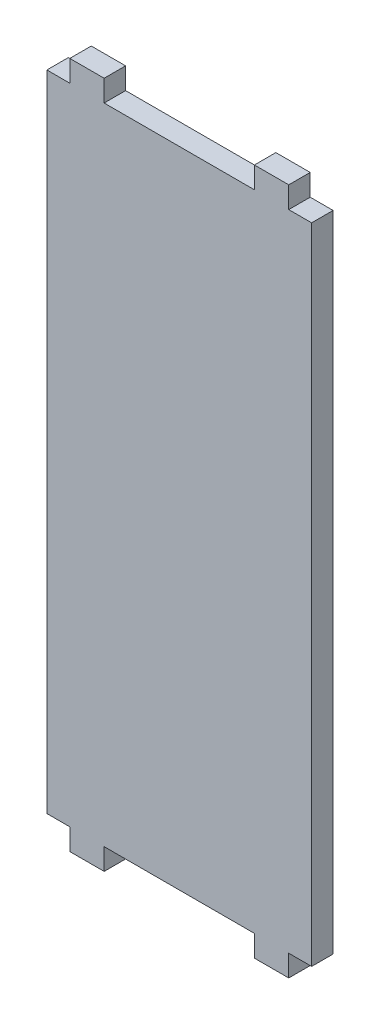
ISO-10303-21;
HEADER;
FILE_DESCRIPTION(('STEP AP214'),'2;1');
FILE_NAME('part.step','',(''),(''),'','','');
FILE_SCHEMA(('AUTOMOTIVE_DESIGN { 1 0 10303 214 1 1 1 1 }'));
ENDSEC;
DATA;
#1=APPLICATION_CONTEXT('core data for automotive mechanical design processes');
#2=APPLICATION_PROTOCOL_DEFINITION('international standard','automotive_design',2000,#1);
#3=PRODUCT_CONTEXT('',#1,'mechanical');
#4=PRODUCT('Part','Part','',(#3));
#5=PRODUCT_RELATED_PRODUCT_CATEGORY('part','',(#4));
#6=PRODUCT_DEFINITION_FORMATION('','',#4);
#7=PRODUCT_DEFINITION_CONTEXT('part definition',#1,'design');
#8=PRODUCT_DEFINITION('design','',#6,#7);
#9=PRODUCT_DEFINITION_SHAPE('','',#8);
#10=(LENGTH_UNIT() NAMED_UNIT(*) SI_UNIT(.MILLI.,.METRE.));
#11=(NAMED_UNIT(*) PLANE_ANGLE_UNIT() SI_UNIT($,.RADIAN.));
#12=(NAMED_UNIT(*) SI_UNIT($,.STERADIAN.) SOLID_ANGLE_UNIT());
#13=UNCERTAINTY_MEASURE_WITH_UNIT(LENGTH_MEASURE(1.E-05),#10,'distance_accuracy_value','');
#14=(GEOMETRIC_REPRESENTATION_CONTEXT(3) GLOBAL_UNCERTAINTY_ASSIGNED_CONTEXT((#13)) GLOBAL_UNIT_ASSIGNED_CONTEXT((#10,
#11,#12)) REPRESENTATION_CONTEXT('',''));
#15=CARTESIAN_POINT('',(0.,0.,0.));
#16=DIRECTION('',(0.,0.,1.));
#17=DIRECTION('',(1.,0.,0.));
#18=AXIS2_PLACEMENT_3D('',#15,#16,#17);
#19=CARTESIAN_POINT('',(0.,142.875,4.7625));
#20=DIRECTION('',(0.,-1.,0.));
#21=DIRECTION('',(1.,0.,0.));
#22=AXIS2_PLACEMENT_3D('',#19,#20,#21);
#23=PLANE('',#22);
#24=DIRECTION('',(-1.,0.,0.));
#25=VECTOR('',#24,1.);
#26=CARTESIAN_POINT('',(0.,142.875,0.));
#27=LINE('',#26,#25);
#28=CARTESIAN_POINT('',(0.,142.875,0.));
#29=VERTEX_POINT('',#28);
#30=CARTESIAN_POINT('',(-5.07999999999998,142.875,0.));
#31=VERTEX_POINT('',#30);
#32=EDGE_CURVE('E246',#29,#31,#27,.T.);
#33=ORIENTED_EDGE('',*,*,#32,.T.);
#34=DIRECTION('',(0.,0.,-1.));
#35=VECTOR('',#34,1.);
#36=CARTESIAN_POINT('',(-5.07999999999998,142.875,4.76249999999998));
#37=LINE('',#36,#35);
#38=CARTESIAN_POINT('',(-5.07999999999998,142.875,4.76249999999998));
#39=VERTEX_POINT('',#38);
#40=EDGE_CURVE('E166',#39,#31,#37,.T.);
#41=ORIENTED_EDGE('',*,*,#40,.F.);
#42=DIRECTION('',(-1.,0.,0.));
#43=VECTOR('',#42,1.);
#44=CARTESIAN_POINT('',(0.,142.875,4.7625));
#45=LINE('',#44,#43);
#46=CARTESIAN_POINT('',(0.,142.875,4.7625));
#47=VERTEX_POINT('',#46);
#48=EDGE_CURVE('E288',#47,#39,#45,.T.);
#49=ORIENTED_EDGE('',*,*,#48,.F.);
#50=DIRECTION('',(0.,0.,-1.));
#51=VECTOR('',#50,1.);
#52=CARTESIAN_POINT('',(0.,142.875,4.7625));
#53=LINE('',#52,#51);
#54=EDGE_CURVE('E163',#47,#29,#53,.T.);
#55=ORIENTED_EDGE('',*,*,#54,.T.);
#56=EDGE_LOOP('',(#33,#41,#49,#55));
#57=FACE_BOUND('',#56,.T.);
#58=ADVANCED_FACE('F93',(#57),#23,.F.);
#59=CARTESIAN_POINT('',(-5.07999999999998,0.,4.7625));
#60=DIRECTION('',(1.,0.,0.));
#61=DIRECTION('',(0.,1.,0.));
#62=AXIS2_PLACEMENT_3D('',#59,#60,#61);
#63=PLANE('',#62);
#64=DIRECTION('',(0.,-1.,0.));
#65=VECTOR('',#64,1.);
#66=CARTESIAN_POINT('',(-5.07999999999998,0.,0.));
#67=LINE('',#66,#65);
#68=CARTESIAN_POINT('',(-5.07999999999995,147.6375,0.));
#69=VERTEX_POINT('',#68);
#70=EDGE_CURVE('E243',#69,#31,#67,.T.);
#71=ORIENTED_EDGE('',*,*,#70,.F.);
#72=DIRECTION('',(0.,0.,-1.));
#73=VECTOR('',#72,1.);
#74=CARTESIAN_POINT('',(-5.07999999999995,147.6375,4.76249999999997));
#75=LINE('',#74,#73);
#76=CARTESIAN_POINT('',(-5.07999999999995,147.6375,4.76249999999997));
#77=VERTEX_POINT('',#76);
#78=EDGE_CURVE('E169',#77,#69,#75,.T.);
#79=ORIENTED_EDGE('',*,*,#78,.F.);
#80=DIRECTION('',(0.,-1.,0.));
#81=VECTOR('',#80,1.);
#82=CARTESIAN_POINT('',(-5.07999999999998,0.,4.7625));
#83=LINE('',#82,#81);
#84=EDGE_CURVE('E285',#77,#39,#83,.T.);
#85=ORIENTED_EDGE('',*,*,#84,.T.);
#86=ORIENTED_EDGE('',*,*,#40,.T.);
#87=EDGE_LOOP('',(#71,#79,#85,#86));
#88=FACE_BOUND('',#87,.T.);
#89=ADVANCED_FACE('F401',(#88),#63,.T.);
#90=CARTESIAN_POINT('',(0.,147.6375,4.76249999999997));
#91=DIRECTION('',(0.,-1.,0.));
#92=DIRECTION('',(1.,0.,0.));
#93=AXIS2_PLACEMENT_3D('',#90,#91,#92);
#94=PLANE('',#93);
#95=DIRECTION('',(-1.,0.,0.));
#96=VECTOR('',#95,1.);
#97=CARTESIAN_POINT('',(0.,147.6375,0.));
#98=LINE('',#97,#96);
#99=CARTESIAN_POINT('',(-12.7,147.6375,0.));
#100=VERTEX_POINT('',#99);
#101=EDGE_CURVE('E240',#69,#100,#98,.T.);
#102=ORIENTED_EDGE('',*,*,#101,.T.);
#103=DIRECTION('',(0.,0.,-1.));
#104=VECTOR('',#103,1.);
#105=CARTESIAN_POINT('',(-12.7,147.6375,4.76249999999997));
#106=LINE('',#105,#104);
#107=CARTESIAN_POINT('',(-12.7,147.6375,4.76249999999997));
#108=VERTEX_POINT('',#107);
#109=EDGE_CURVE('E172',#108,#100,#106,.T.);
#110=ORIENTED_EDGE('',*,*,#109,.F.);
#111=DIRECTION('',(-1.,0.,0.));
#112=VECTOR('',#111,1.);
#113=CARTESIAN_POINT('',(0.,147.6375,4.76249999999997));
#114=LINE('',#113,#112);
#115=EDGE_CURVE('E282',#77,#108,#114,.T.);
#116=ORIENTED_EDGE('',*,*,#115,.F.);
#117=ORIENTED_EDGE('',*,*,#78,.T.);
#118=EDGE_LOOP('',(#102,#110,#116,#117));
#119=FACE_BOUND('',#118,.T.);
#120=ADVANCED_FACE('F460',(#119),#94,.F.);
#121=CARTESIAN_POINT('',(-12.7,0.,4.7625));
#122=DIRECTION('',(1.,0.,0.));
#123=DIRECTION('',(0.,1.,0.));
#124=AXIS2_PLACEMENT_3D('',#121,#122,#123);
#125=PLANE('',#124);
#126=DIRECTION('',(0.,-1.,0.));
#127=VECTOR('',#126,1.);
#128=CARTESIAN_POINT('',(-12.7,0.,0.));
#129=LINE('',#128,#127);
#130=CARTESIAN_POINT('',(-12.7,142.875,0.));
#131=VERTEX_POINT('',#130);
#132=EDGE_CURVE('E237',#100,#131,#129,.T.);
#133=ORIENTED_EDGE('',*,*,#132,.T.);
#134=DIRECTION('',(0.,0.,-1.));
#135=VECTOR('',#134,1.);
#136=CARTESIAN_POINT('',(-12.7,142.875,4.7625));
#137=LINE('',#136,#135);
#138=CARTESIAN_POINT('',(-12.7,142.875,4.7625));
#139=VERTEX_POINT('',#138);
#140=EDGE_CURVE('E175',#139,#131,#137,.T.);
#141=ORIENTED_EDGE('',*,*,#140,.F.);
#142=DIRECTION('',(0.,-1.,0.));
#143=VECTOR('',#142,1.);
#144=CARTESIAN_POINT('',(-12.7,0.,4.7625));
#145=LINE('',#144,#143);
#146=EDGE_CURVE('E279',#108,#139,#145,.T.);
#147=ORIENTED_EDGE('',*,*,#146,.F.);
#148=ORIENTED_EDGE('',*,*,#109,.T.);
#149=EDGE_LOOP('',(#133,#141,#147,#148));
#150=FACE_BOUND('',#149,.T.);
#151=ADVANCED_FACE('F392',(#150),#125,.F.);
#152=CARTESIAN_POINT('',(-46.0375,142.875,0.));
#153=VERTEX_POINT('',#152);
#154=EDGE_CURVE('E236',#131,#153,#27,.T.);
#155=ORIENTED_EDGE('',*,*,#154,.T.);
#156=DIRECTION('',(0.,0.,-1.));
#157=VECTOR('',#156,1.);
#158=CARTESIAN_POINT('',(-46.0375,142.875,4.7625));
#159=LINE('',#158,#157);
#160=CARTESIAN_POINT('',(-46.0375,142.875,4.7625));
#161=VERTEX_POINT('',#160);
#162=EDGE_CURVE('E178',#161,#153,#159,.T.);
#163=ORIENTED_EDGE('',*,*,#162,.F.);
#164=EDGE_CURVE('E278',#139,#161,#45,.T.);
#165=ORIENTED_EDGE('',*,*,#164,.F.);
#166=ORIENTED_EDGE('',*,*,#140,.T.);
#167=EDGE_LOOP('',(#155,#163,#165,#166));
#168=FACE_BOUND('',#167,.T.);
#169=ADVANCED_FACE('F331',(#168),#23,.F.);
#170=CARTESIAN_POINT('',(-46.0375,0.,4.7625));
#171=DIRECTION('',(-1.,0.,0.));
#172=DIRECTION('',(0.,-1.,0.));
#173=AXIS2_PLACEMENT_3D('',#170,#171,#172);
#174=PLANE('',#173);
#175=DIRECTION('',(0.,1.,0.));
#176=VECTOR('',#175,1.);
#177=CARTESIAN_POINT('',(-46.0375,0.,0.));
#178=LINE('',#177,#176);
#179=CARTESIAN_POINT('',(-46.0375,147.6375,0.));
#180=VERTEX_POINT('',#179);
#181=EDGE_CURVE('E233',#153,#180,#178,.T.);
#182=ORIENTED_EDGE('',*,*,#181,.T.);
#183=DIRECTION('',(0.,0.,-1.));
#184=VECTOR('',#183,1.);
#185=CARTESIAN_POINT('',(-46.0375,147.6375,4.76249999999994));
#186=LINE('',#185,#184);
#187=CARTESIAN_POINT('',(-46.0375,147.6375,4.76249999999994));
#188=VERTEX_POINT('',#187);
#189=EDGE_CURVE('E181',#188,#180,#186,.T.);
#190=ORIENTED_EDGE('',*,*,#189,.F.);
#191=DIRECTION('',(0.,1.,0.));
#192=VECTOR('',#191,1.);
#193=CARTESIAN_POINT('',(-46.0375,0.,4.7625));
#194=LINE('',#193,#192);
#195=EDGE_CURVE('E275',#161,#188,#194,.T.);
#196=ORIENTED_EDGE('',*,*,#195,.F.);
#197=ORIENTED_EDGE('',*,*,#162,.T.);
#198=EDGE_LOOP('',(#182,#190,#196,#197));
#199=FACE_BOUND('',#198,.T.);
#200=ADVANCED_FACE('F342',(#199),#174,.F.);
#201=CARTESIAN_POINT('',(0.,147.6375,4.76249999999994));
#202=DIRECTION('',(0.,-1.,0.));
#203=DIRECTION('',(1.,0.,0.));
#204=AXIS2_PLACEMENT_3D('',#201,#202,#203);
#205=PLANE('',#204);
#206=DIRECTION('',(-1.,0.,0.));
#207=VECTOR('',#206,1.);
#208=CARTESIAN_POINT('',(0.,147.6375,0.));
#209=LINE('',#208,#207);
#210=CARTESIAN_POINT('',(-53.6575,147.6375,0.));
#211=VERTEX_POINT('',#210);
#212=EDGE_CURVE('E230',#180,#211,#209,.T.);
#213=ORIENTED_EDGE('',*,*,#212,.T.);
#214=DIRECTION('',(0.,0.,-1.));
#215=VECTOR('',#214,1.);
#216=CARTESIAN_POINT('',(-53.6575,147.6375,4.76249999999994));
#217=LINE('',#216,#215);
#218=CARTESIAN_POINT('',(-53.6575,147.6375,4.76249999999994));
#219=VERTEX_POINT('',#218);
#220=EDGE_CURVE('E184',#219,#211,#217,.T.);
#221=ORIENTED_EDGE('',*,*,#220,.F.);
#222=DIRECTION('',(-1.,0.,0.));
#223=VECTOR('',#222,1.);
#224=CARTESIAN_POINT('',(0.,147.6375,4.76249999999994));
#225=LINE('',#224,#223);
#226=EDGE_CURVE('E272',#188,#219,#225,.T.);
#227=ORIENTED_EDGE('',*,*,#226,.F.);
#228=ORIENTED_EDGE('',*,*,#189,.T.);
#229=EDGE_LOOP('',(#213,#221,#227,#228));
#230=FACE_BOUND('',#229,.T.);
#231=ADVANCED_FACE('F349',(#230),#205,.F.);
#232=CARTESIAN_POINT('',(-53.6575,0.,4.7625));
#233=DIRECTION('',(-1.,0.,0.));
#234=DIRECTION('',(0.,-1.,0.));
#235=AXIS2_PLACEMENT_3D('',#232,#233,#234);
#236=PLANE('',#235);
#237=DIRECTION('',(0.,1.,0.));
#238=VECTOR('',#237,1.);
#239=CARTESIAN_POINT('',(-53.6575,0.,0.));
#240=LINE('',#239,#238);
#241=CARTESIAN_POINT('',(-53.6575,142.875,0.));
#242=VERTEX_POINT('',#241);
#243=EDGE_CURVE('E227',#242,#211,#240,.T.);
#244=ORIENTED_EDGE('',*,*,#243,.F.);
#245=DIRECTION('',(0.,0.,-1.));
#246=VECTOR('',#245,1.);
#247=CARTESIAN_POINT('',(-53.6575,142.875,4.76249999999997));
#248=LINE('',#247,#246);
#249=CARTESIAN_POINT('',(-53.6575,142.875,4.76249999999997));
#250=VERTEX_POINT('',#249);
#251=EDGE_CURVE('E187',#250,#242,#248,.T.);
#252=ORIENTED_EDGE('',*,*,#251,.F.);
#253=DIRECTION('',(0.,1.,0.));
#254=VECTOR('',#253,1.);
#255=CARTESIAN_POINT('',(-53.6575,0.,4.7625));
#256=LINE('',#255,#254);
#257=EDGE_CURVE('E269',#250,#219,#256,.T.);
#258=ORIENTED_EDGE('',*,*,#257,.T.);
#259=ORIENTED_EDGE('',*,*,#220,.T.);
#260=EDGE_LOOP('',(#244,#252,#258,#259));
#261=FACE_BOUND('',#260,.T.);
#262=ADVANCED_FACE('F466',(#261),#236,.T.);
#263=CARTESIAN_POINT('',(-58.7375,142.875,0.));
#264=VERTEX_POINT('',#263);
#265=EDGE_CURVE('E226',#242,#264,#27,.T.);
#266=ORIENTED_EDGE('',*,*,#265,.T.);
#267=DIRECTION('',(0.,0.,-1.));
#268=VECTOR('',#267,1.);
#269=CARTESIAN_POINT('',(-58.7375,142.875,4.7625));
#270=LINE('',#269,#268);
#271=CARTESIAN_POINT('',(-58.7375,142.875,4.7625));
#272=VERTEX_POINT('',#271);
#273=EDGE_CURVE('E190',#272,#264,#270,.T.);
#274=ORIENTED_EDGE('',*,*,#273,.F.);
#275=EDGE_CURVE('E268',#250,#272,#45,.T.);
#276=ORIENTED_EDGE('',*,*,#275,.F.);
#277=ORIENTED_EDGE('',*,*,#251,.T.);
#278=EDGE_LOOP('',(#266,#274,#276,#277));
#279=FACE_BOUND('',#278,.T.);
#280=ADVANCED_FACE('F323',(#279),#23,.F.);
#281=CARTESIAN_POINT('',(-58.7375,0.,4.7625));
#282=DIRECTION('',(-1.,0.,0.));
#283=DIRECTION('',(0.,-1.,0.));
#284=AXIS2_PLACEMENT_3D('',#281,#282,#283);
#285=PLANE('',#284);
#286=DIRECTION('',(0.,1.,0.));
#287=VECTOR('',#286,1.);
#288=CARTESIAN_POINT('',(-58.7375,0.,0.));
#289=LINE('',#288,#287);
#290=CARTESIAN_POINT('',(-58.7375,0.,0.));
#291=VERTEX_POINT('',#290);
#292=EDGE_CURVE('E223',#291,#264,#289,.T.);
#293=ORIENTED_EDGE('',*,*,#292,.F.);
#294=DIRECTION('',(0.,0.,-1.));
#295=VECTOR('',#294,1.);
#296=CARTESIAN_POINT('',(-58.7375,0.,4.7625));
#297=LINE('',#296,#295);
#298=CARTESIAN_POINT('',(-58.7375,0.,4.7625));
#299=VERTEX_POINT('',#298);
#300=EDGE_CURVE('E193',#299,#291,#297,.T.);
#301=ORIENTED_EDGE('',*,*,#300,.F.);
#302=DIRECTION('',(0.,1.,0.));
#303=VECTOR('',#302,1.);
#304=CARTESIAN_POINT('',(-58.7375,0.,4.7625));
#305=LINE('',#304,#303);
#306=EDGE_CURVE('E265',#299,#272,#305,.T.);
#307=ORIENTED_EDGE('',*,*,#306,.T.);
#308=ORIENTED_EDGE('',*,*,#273,.T.);
#309=EDGE_LOOP('',(#293,#301,#307,#308));
#310=FACE_BOUND('',#309,.T.);
#311=ADVANCED_FACE('F315',(#310),#285,.T.);
#312=CARTESIAN_POINT('',(0.,0.,4.7625));
#313=DIRECTION('',(0.,-1.,0.));
#314=DIRECTION('',(1.,0.,0.));
#315=AXIS2_PLACEMENT_3D('',#312,#313,#314);
#316=PLANE('',#315);
#317=DIRECTION('',(0.,0.,-1.));
#318=VECTOR('',#317,1.);
#319=CARTESIAN_POINT('',(-53.6575,0.,4.7625));
#320=LINE('',#319,#318);
#321=CARTESIAN_POINT('',(-53.6575,0.,4.7625));
#322=VERTEX_POINT('',#321);
#323=CARTESIAN_POINT('',(-53.6575,0.,0.));
#324=VERTEX_POINT('',#323);
#325=EDGE_CURVE('E103',#322,#324,#320,.T.);
#326=ORIENTED_EDGE('',*,*,#325,.F.);
#327=DIRECTION('',(-1.,0.,0.));
#328=VECTOR('',#327,1.);
#329=CARTESIAN_POINT('',(0.,0.,4.7625));
#330=LINE('',#329,#328);
#331=EDGE_CURVE('E264',#322,#299,#330,.T.);
#332=ORIENTED_EDGE('',*,*,#331,.T.);
#333=ORIENTED_EDGE('',*,*,#300,.T.);
#334=DIRECTION('',(-1.,0.,0.));
#335=VECTOR('',#334,1.);
#336=CARTESIAN_POINT('',(0.,0.,0.));
#337=LINE('',#336,#335);
#338=EDGE_CURVE('E222',#324,#291,#337,.T.);
#339=ORIENTED_EDGE('',*,*,#338,.F.);
#340=EDGE_LOOP('',(#326,#332,#333,#339));
#341=FACE_BOUND('',#340,.T.);
#342=ADVANCED_FACE('F310',(#341),#316,.T.);
#343=CARTESIAN_POINT('',(-12.7,0.,4.7625));
#344=VERTEX_POINT('',#343);
#345=CARTESIAN_POINT('',(-46.0375,0.,4.7625));
#346=VERTEX_POINT('',#345);
#347=EDGE_CURVE('E261',#344,#346,#330,.T.);
#348=ORIENTED_EDGE('',*,*,#347,.T.);
#349=DIRECTION('',(0.,0.,-1.));
#350=VECTOR('',#349,1.);
#351=CARTESIAN_POINT('',(-46.0375,0.,4.7625));
#352=LINE('',#351,#350);
#353=CARTESIAN_POINT('',(-46.0375,0.,0.));
#354=VERTEX_POINT('',#353);
#355=EDGE_CURVE('E12',#346,#354,#352,.T.);
#356=ORIENTED_EDGE('',*,*,#355,.T.);
#357=CARTESIAN_POINT('',(-12.7,0.,0.));
#358=VERTEX_POINT('',#357);
#359=EDGE_CURVE('E151',#358,#354,#337,.T.);
#360=ORIENTED_EDGE('',*,*,#359,.F.);
#361=DIRECTION('',(0.,0.,-1.));
#362=VECTOR('',#361,1.);
#363=CARTESIAN_POINT('',(-12.7,0.,4.7625));
#364=LINE('',#363,#362);
#365=EDGE_CURVE('E196',#344,#358,#364,.T.);
#366=ORIENTED_EDGE('',*,*,#365,.F.);
#367=EDGE_LOOP('',(#348,#356,#360,#366));
#368=FACE_BOUND('',#367,.T.);
#369=ADVANCED_FACE('F444',(#368),#316,.T.);
#370=CARTESIAN_POINT('',(-12.7,0.,4.7625));
#371=DIRECTION('',(-1.,0.,0.));
#372=DIRECTION('',(0.,-1.,0.));
#373=AXIS2_PLACEMENT_3D('',#370,#371,#372);
#374=PLANE('',#373);
#375=DIRECTION('',(0.,1.,0.));
#376=VECTOR('',#375,1.);
#377=CARTESIAN_POINT('',(-12.7,0.,0.));
#378=LINE('',#377,#376);
#379=CARTESIAN_POINT('',(-12.7,-4.7625,0.));
#380=VERTEX_POINT('',#379);
#381=EDGE_CURVE('E219',#380,#358,#378,.T.);
#382=ORIENTED_EDGE('',*,*,#381,.F.);
#383=DIRECTION('',(0.,0.,-1.));
#384=VECTOR('',#383,1.);
#385=CARTESIAN_POINT('',(-12.7,-4.7625,4.7625));
#386=LINE('',#385,#384);
#387=CARTESIAN_POINT('',(-12.7,-4.7625,4.7625));
#388=VERTEX_POINT('',#387);
#389=EDGE_CURVE('E199',#388,#380,#386,.T.);
#390=ORIENTED_EDGE('',*,*,#389,.F.);
#391=DIRECTION('',(0.,1.,0.));
#392=VECTOR('',#391,1.);
#393=CARTESIAN_POINT('',(-12.7,0.,4.7625));
#394=LINE('',#393,#392);
#395=EDGE_CURVE('E258',#388,#344,#394,.T.);
#396=ORIENTED_EDGE('',*,*,#395,.T.);
#397=ORIENTED_EDGE('',*,*,#365,.T.);
#398=EDGE_LOOP('',(#382,#390,#396,#397));
#399=FACE_BOUND('',#398,.T.);
#400=ADVANCED_FACE('F442',(#399),#374,.T.);
#401=CARTESIAN_POINT('',(0.,-4.7625,4.7625));
#402=DIRECTION('',(0.,-1.,0.));
#403=DIRECTION('',(1.,0.,0.));
#404=AXIS2_PLACEMENT_3D('',#401,#402,#403);
#405=PLANE('',#404);
#406=DIRECTION('',(-1.,0.,0.));
#407=VECTOR('',#406,1.);
#408=CARTESIAN_POINT('',(0.,-4.7625,0.));
#409=LINE('',#408,#407);
#410=CARTESIAN_POINT('',(-5.07999999999993,-4.76250000000009,0.));
#411=VERTEX_POINT('',#410);
#412=EDGE_CURVE('E216',#411,#380,#409,.T.);
#413=ORIENTED_EDGE('',*,*,#412,.F.);
#414=DIRECTION('',(0.,0.,-1.));
#415=VECTOR('',#414,1.);
#416=CARTESIAN_POINT('',(-5.07999999999993,-4.76250000000009,4.76249999999991));
#417=LINE('',#416,#415);
#418=CARTESIAN_POINT('',(-5.07999999999993,-4.76250000000009,4.76249999999991));
#419=VERTEX_POINT('',#418);
#420=EDGE_CURVE('E202',#419,#411,#417,.T.);
#421=ORIENTED_EDGE('',*,*,#420,.F.);
#422=DIRECTION('',(-1.,0.,0.));
#423=VECTOR('',#422,1.);
#424=CARTESIAN_POINT('',(0.,-4.7625,4.7625));
#425=LINE('',#424,#423);
#426=EDGE_CURVE('E255',#419,#388,#425,.T.);
#427=ORIENTED_EDGE('',*,*,#426,.T.);
#428=ORIENTED_EDGE('',*,*,#389,.T.);
#429=EDGE_LOOP('',(#413,#421,#427,#428));
#430=FACE_BOUND('',#429,.T.);
#431=ADVANCED_FACE('F435',(#430),#405,.T.);
#432=CARTESIAN_POINT('',(-5.08000000000002,0.,4.7625));
#433=DIRECTION('',(-1.,0.,0.));
#434=DIRECTION('',(0.,-1.,0.));
#435=AXIS2_PLACEMENT_3D('',#432,#433,#434);
#436=PLANE('',#435);
#437=DIRECTION('',(0.,1.,0.));
#438=VECTOR('',#437,1.);
#439=CARTESIAN_POINT('',(-5.08000000000002,0.,0.));
#440=LINE('',#439,#438);
#441=CARTESIAN_POINT('',(-5.08000000000002,0.,0.));
#442=VERTEX_POINT('',#441);
#443=EDGE_CURVE('E212',#411,#442,#440,.T.);
#444=ORIENTED_EDGE('',*,*,#443,.T.);
#445=DIRECTION('',(0.,0.,-1.));
#446=VECTOR('',#445,1.);
#447=CARTESIAN_POINT('',(-5.08000000000002,0.,4.7625));
#448=LINE('',#447,#446);
#449=CARTESIAN_POINT('',(-5.08000000000002,0.,4.7625));
#450=VERTEX_POINT('',#449);
#451=EDGE_CURVE('E205',#450,#442,#448,.T.);
#452=ORIENTED_EDGE('',*,*,#451,.F.);
#453=DIRECTION('',(0.,1.,0.));
#454=VECTOR('',#453,1.);
#455=CARTESIAN_POINT('',(-5.08000000000002,0.,4.7625));
#456=LINE('',#455,#454);
#457=EDGE_CURVE('E252',#419,#450,#456,.T.);
#458=ORIENTED_EDGE('',*,*,#457,.F.);
#459=ORIENTED_EDGE('',*,*,#420,.T.);
#460=EDGE_LOOP('',(#444,#452,#458,#459));
#461=FACE_BOUND('',#460,.T.);
#462=ADVANCED_FACE('F437',(#461),#436,.F.);
#463=CARTESIAN_POINT('',(0.,0.,0.));
#464=VERTEX_POINT('',#463);
#465=EDGE_CURVE('E215',#464,#442,#337,.T.);
#466=ORIENTED_EDGE('',*,*,#465,.F.);
#467=DIRECTION('',(0.,0.,-1.));
#468=VECTOR('',#467,1.);
#469=CARTESIAN_POINT('',(0.,0.,4.7625));
#470=LINE('',#469,#468);
#471=CARTESIAN_POINT('',(0.,0.,4.7625));
#472=VERTEX_POINT('',#471);
#473=EDGE_CURVE('E208',#472,#464,#470,.T.);
#474=ORIENTED_EDGE('',*,*,#473,.F.);
#475=EDGE_CURVE('E211',#472,#450,#330,.T.);
#476=ORIENTED_EDGE('',*,*,#475,.T.);
#477=ORIENTED_EDGE('',*,*,#451,.T.);
#478=EDGE_LOOP('',(#466,#474,#476,#477));
#479=FACE_BOUND('',#478,.T.);
#480=ADVANCED_FACE('F374',(#479),#316,.T.);
#481=CARTESIAN_POINT('',(0.,0.,4.7625));
#482=DIRECTION('',(-1.,0.,0.));
#483=DIRECTION('',(0.,-1.,0.));
#484=AXIS2_PLACEMENT_3D('',#481,#482,#483);
#485=PLANE('',#484);
#486=DIRECTION('',(0.,1.,0.));
#487=VECTOR('',#486,1.);
#488=CARTESIAN_POINT('',(0.,0.,0.));
#489=LINE('',#488,#487);
#490=EDGE_CURVE('E249',#464,#29,#489,.T.);
#491=ORIENTED_EDGE('',*,*,#490,.T.);
#492=ORIENTED_EDGE('',*,*,#54,.F.);
#493=DIRECTION('',(0.,1.,0.));
#494=VECTOR('',#493,1.);
#495=CARTESIAN_POINT('',(0.,0.,4.7625));
#496=LINE('',#495,#494);
#497=EDGE_CURVE('E291',#472,#47,#496,.T.);
#498=ORIENTED_EDGE('',*,*,#497,.F.);
#499=ORIENTED_EDGE('',*,*,#473,.T.);
#500=EDGE_LOOP('',(#491,#492,#498,#499));
#501=FACE_BOUND('',#500,.T.);
#502=ADVANCED_FACE('F410',(#501),#485,.F.);
#503=CARTESIAN_POINT('',(0.,0.,0.));
#504=DIRECTION('',(0.,0.,1.));
#505=DIRECTION('',(1.,0.,0.));
#506=AXIS2_PLACEMENT_3D('',#503,#504,#505);
#507=PLANE('',#506);
#508=ORIENTED_EDGE('',*,*,#490,.F.);
#509=ORIENTED_EDGE('',*,*,#465,.T.);
#510=ORIENTED_EDGE('',*,*,#443,.F.);
#511=ORIENTED_EDGE('',*,*,#412,.T.);
#512=ORIENTED_EDGE('',*,*,#381,.T.);
#513=ORIENTED_EDGE('',*,*,#359,.T.);
#514=DIRECTION('',(0.,1.,0.));
#515=VECTOR('',#514,1.);
#516=CARTESIAN_POINT('',(-46.0375,-4.76249999999999,0.));
#517=LINE('',#516,#515);
#518=CARTESIAN_POINT('',(-46.0375,-4.76249999999999,0.));
#519=VERTEX_POINT('',#518);
#520=EDGE_CURVE('E137',#519,#354,#517,.T.);
#521=ORIENTED_EDGE('',*,*,#520,.F.);
#522=DIRECTION('',(-1.,0.,0.));
#523=VECTOR('',#522,1.);
#524=CARTESIAN_POINT('',(-46.0375,-4.76249999999999,0.));
#525=LINE('',#524,#523);
#526=CARTESIAN_POINT('',(-53.6575,-4.76249999999999,0.));
#527=VERTEX_POINT('',#526);
#528=EDGE_CURVE('E148',#519,#527,#525,.T.);
#529=ORIENTED_EDGE('',*,*,#528,.T.);
#530=DIRECTION('',(0.,1.,0.));
#531=VECTOR('',#530,1.);
#532=CARTESIAN_POINT('',(-53.6575,-4.76249999999999,0.));
#533=LINE('',#532,#531);
#534=EDGE_CURVE('E152',#527,#324,#533,.T.);
#535=ORIENTED_EDGE('',*,*,#534,.T.);
#536=ORIENTED_EDGE('',*,*,#338,.T.);
#537=ORIENTED_EDGE('',*,*,#292,.T.);
#538=ORIENTED_EDGE('',*,*,#265,.F.);
#539=ORIENTED_EDGE('',*,*,#243,.T.);
#540=ORIENTED_EDGE('',*,*,#212,.F.);
#541=ORIENTED_EDGE('',*,*,#181,.F.);
#542=ORIENTED_EDGE('',*,*,#154,.F.);
#543=ORIENTED_EDGE('',*,*,#132,.F.);
#544=ORIENTED_EDGE('',*,*,#101,.F.);
#545=ORIENTED_EDGE('',*,*,#70,.T.);
#546=ORIENTED_EDGE('',*,*,#32,.F.);
#547=EDGE_LOOP('',(#508,#509,#510,#511,#512,#513,#521,#529,#535,#536,#537,#538,#539,#540,#541,
#542,#543,#544,#545,#546));
#548=FACE_BOUND('',#547,.T.);
#549=ADVANCED_FACE('F146',(#548),#507,.F.);
#550=CARTESIAN_POINT('',(0.,0.,4.7625));
#551=DIRECTION('',(0.,0.,1.));
#552=DIRECTION('',(1.,0.,0.));
#553=AXIS2_PLACEMENT_3D('',#550,#551,#552);
#554=PLANE('',#553);
#555=ORIENTED_EDGE('',*,*,#497,.T.);
#556=ORIENTED_EDGE('',*,*,#48,.T.);
#557=ORIENTED_EDGE('',*,*,#84,.F.);
#558=ORIENTED_EDGE('',*,*,#115,.T.);
#559=ORIENTED_EDGE('',*,*,#146,.T.);
#560=ORIENTED_EDGE('',*,*,#164,.T.);
#561=ORIENTED_EDGE('',*,*,#195,.T.);
#562=ORIENTED_EDGE('',*,*,#226,.T.);
#563=ORIENTED_EDGE('',*,*,#257,.F.);
#564=ORIENTED_EDGE('',*,*,#275,.T.);
#565=ORIENTED_EDGE('',*,*,#306,.F.);
#566=ORIENTED_EDGE('',*,*,#331,.F.);
#567=DIRECTION('',(0.,1.,0.));
#568=VECTOR('',#567,1.);
#569=CARTESIAN_POINT('',(-53.6575,-4.76249999999999,4.7625));
#570=LINE('',#569,#568);
#571=CARTESIAN_POINT('',(-53.6575,-4.76249999999999,4.7625));
#572=VERTEX_POINT('',#571);
#573=EDGE_CURVE('E156',#572,#322,#570,.T.);
#574=ORIENTED_EDGE('',*,*,#573,.F.);
#575=DIRECTION('',(-1.,0.,0.));
#576=VECTOR('',#575,1.);
#577=CARTESIAN_POINT('',(-46.0375,-4.76249999999999,4.7625));
#578=LINE('',#577,#576);
#579=CARTESIAN_POINT('',(-46.0375,-4.76249999999999,4.7625));
#580=VERTEX_POINT('',#579);
#581=EDGE_CURVE('E142',#580,#572,#578,.T.);
#582=ORIENTED_EDGE('',*,*,#581,.F.);
#583=DIRECTION('',(0.,1.,0.));
#584=VECTOR('',#583,1.);
#585=CARTESIAN_POINT('',(-46.0375,-4.76249999999999,4.7625));
#586=LINE('',#585,#584);
#587=EDGE_CURVE('E140',#580,#346,#586,.T.);
#588=ORIENTED_EDGE('',*,*,#587,.T.);
#589=ORIENTED_EDGE('',*,*,#347,.F.);
#590=ORIENTED_EDGE('',*,*,#395,.F.);
#591=ORIENTED_EDGE('',*,*,#426,.F.);
#592=ORIENTED_EDGE('',*,*,#457,.T.);
#593=ORIENTED_EDGE('',*,*,#475,.F.);
#594=EDGE_LOOP('',(#555,#556,#557,#558,#559,#560,#561,#562,#563,#564,#565,#566,#574,#582,#588,
#589,#590,#591,#592,#593));
#595=FACE_BOUND('',#594,.T.);
#596=ADVANCED_FACE('F368',(#595),#554,.T.);
#597=CARTESIAN_POINT('',(-53.6575,-4.76249999999999,4.7625));
#598=DIRECTION('',(-1.,0.,0.));
#599=DIRECTION('',(0.,0.,1.));
#600=AXIS2_PLACEMENT_3D('',#597,#598,#599);
#601=PLANE('',#600);
#602=ORIENTED_EDGE('',*,*,#534,.F.);
#603=DIRECTION('',(0.,0.,-1.));
#604=VECTOR('',#603,1.);
#605=CARTESIAN_POINT('',(-53.6575,-4.76249999999999,4.7625));
#606=LINE('',#605,#604);
#607=EDGE_CURVE('E97',#572,#527,#606,.T.);
#608=ORIENTED_EDGE('',*,*,#607,.F.);
#609=ORIENTED_EDGE('',*,*,#573,.T.);
#610=ORIENTED_EDGE('',*,*,#325,.T.);
#611=EDGE_LOOP('',(#602,#608,#609,#610));
#612=FACE_BOUND('',#611,.T.);
#613=ADVANCED_FACE('F366',(#612),#601,.T.);
#614=CARTESIAN_POINT('',(-46.0375,-4.76249999999999,4.7625));
#615=DIRECTION('',(0.,-1.,0.));
#616=DIRECTION('',(0.,0.,-1.));
#617=AXIS2_PLACEMENT_3D('',#614,#615,#616);
#618=PLANE('',#617);
#619=ORIENTED_EDGE('',*,*,#528,.F.);
#620=DIRECTION('',(0.,0.,-1.));
#621=VECTOR('',#620,1.);
#622=CARTESIAN_POINT('',(-46.0375,-4.76249999999999,4.7625));
#623=LINE('',#622,#621);
#624=EDGE_CURVE('E134',#580,#519,#623,.T.);
#625=ORIENTED_EDGE('',*,*,#624,.F.);
#626=ORIENTED_EDGE('',*,*,#581,.T.);
#627=ORIENTED_EDGE('',*,*,#607,.T.);
#628=EDGE_LOOP('',(#619,#625,#626,#627));
#629=FACE_BOUND('',#628,.T.);
#630=ADVANCED_FACE('F154',(#629),#618,.T.);
#631=CARTESIAN_POINT('',(-46.0375,-4.76249999999999,4.7625));
#632=DIRECTION('',(-1.,0.,0.));
#633=DIRECTION('',(0.,0.,1.));
#634=AXIS2_PLACEMENT_3D('',#631,#632,#633);
#635=PLANE('',#634);
#636=ORIENTED_EDGE('',*,*,#520,.T.);
#637=ORIENTED_EDGE('',*,*,#355,.F.);
#638=ORIENTED_EDGE('',*,*,#587,.F.);
#639=ORIENTED_EDGE('',*,*,#624,.T.);
#640=EDGE_LOOP('',(#636,#637,#638,#639));
#641=FACE_BOUND('',#640,.T.);
#642=ADVANCED_FACE('F95',(#641),#635,.F.);
#643=CLOSED_SHELL('',(#58,#89,#120,#151,#169,#200,#231,#262,#280,#311,#342,#369,#400,#431,#462,
#480,#502,#549,#596,#613,#630,#642));
#644=MANIFOLD_SOLID_BREP('B2',#643);
#645=ADVANCED_BREP_SHAPE_REPRESENTATION('',(#18,#644),#14);
#646=SHAPE_DEFINITION_REPRESENTATION(#9,#645);
ENDSEC;
END-ISO-10303-21;
